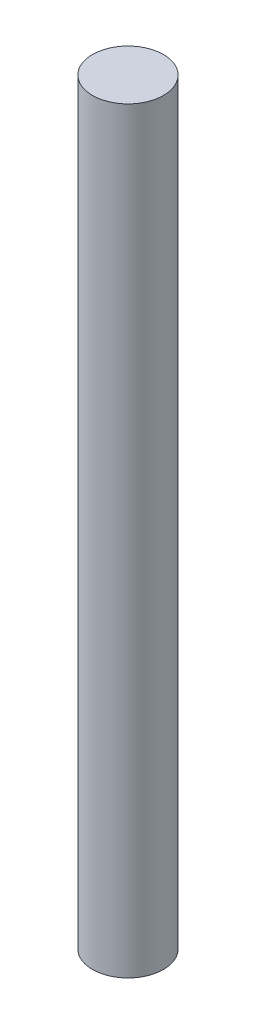
ISO-10303-21;
HEADER;
FILE_DESCRIPTION(('STEP AP214'),'2;1');
FILE_NAME('part.step','',(''),(''),'','','');
FILE_SCHEMA(('AUTOMOTIVE_DESIGN { 1 0 10303 214 1 1 1 1 }'));
ENDSEC;
DATA;
#1=APPLICATION_CONTEXT('core data for automotive mechanical design processes');
#2=APPLICATION_PROTOCOL_DEFINITION('international standard','automotive_design',2000,#1);
#3=PRODUCT_CONTEXT('',#1,'mechanical');
#4=PRODUCT('Part','Part','',(#3));
#5=PRODUCT_RELATED_PRODUCT_CATEGORY('part','',(#4));
#6=PRODUCT_DEFINITION_FORMATION('','',#4);
#7=PRODUCT_DEFINITION_CONTEXT('part definition',#1,'design');
#8=PRODUCT_DEFINITION('design','',#6,#7);
#9=PRODUCT_DEFINITION_SHAPE('','',#8);
#10=(LENGTH_UNIT() NAMED_UNIT(*) SI_UNIT(.MILLI.,.METRE.));
#11=(NAMED_UNIT(*) PLANE_ANGLE_UNIT() SI_UNIT($,.RADIAN.));
#12=(NAMED_UNIT(*) SI_UNIT($,.STERADIAN.) SOLID_ANGLE_UNIT());
#13=UNCERTAINTY_MEASURE_WITH_UNIT(LENGTH_MEASURE(1.E-05),#10,'distance_accuracy_value','');
#14=(GEOMETRIC_REPRESENTATION_CONTEXT(3) GLOBAL_UNCERTAINTY_ASSIGNED_CONTEXT((#13)) GLOBAL_UNIT_ASSIGNED_CONTEXT((#10,
#11,#12)) REPRESENTATION_CONTEXT('',''));
#15=CARTESIAN_POINT('',(0.,0.,0.));
#16=DIRECTION('',(0.,0.,1.));
#17=DIRECTION('',(1.,0.,0.));
#18=AXIS2_PLACEMENT_3D('',#15,#16,#17);
#19=CARTESIAN_POINT('',(0.,50.8,0.));
#20=DIRECTION('',(0.,-1.,0.));
#21=DIRECTION('',(0.,0.,-1.));
#22=AXIS2_PLACEMENT_3D('',#19,#20,#21);
#23=CYLINDRICAL_SURFACE('',#22,2.38125);
#24=CARTESIAN_POINT('',(0.,50.8,0.));
#25=DIRECTION('',(0.,1.,0.));
#26=DIRECTION('',(0.,0.,1.));
#27=AXIS2_PLACEMENT_3D('',#24,#25,#26);
#28=CIRCLE('',#27,2.38125);
#29=CARTESIAN_POINT('',(0.,50.8,2.38125));
#30=VERTEX_POINT('',#29);
#31=EDGE_CURVE('E10',#30,#30,#28,.T.);
#32=ORIENTED_EDGE('',*,*,#31,.F.);
#33=EDGE_LOOP('',(#32));
#34=FACE_BOUND('',#33,.T.);
#35=CARTESIAN_POINT('',(0.,0.,0.));
#36=DIRECTION('',(0.,1.,0.));
#37=DIRECTION('',(0.,0.,1.));
#38=AXIS2_PLACEMENT_3D('',#35,#36,#37);
#39=CIRCLE('',#38,2.38125);
#40=CARTESIAN_POINT('',(0.,0.,2.38125));
#41=VERTEX_POINT('',#40);
#42=EDGE_CURVE('E36',#41,#41,#39,.T.);
#43=ORIENTED_EDGE('',*,*,#42,.T.);
#44=EDGE_LOOP('',(#43));
#45=FACE_BOUND('',#44,.T.);
#46=ADVANCED_FACE('F33',(#34,#45),#23,.T.);
#47=CARTESIAN_POINT('',(0.,50.8,0.));
#48=DIRECTION('',(0.,1.,0.));
#49=DIRECTION('',(0.,0.,1.));
#50=AXIS2_PLACEMENT_3D('',#47,#48,#49);
#51=PLANE('',#50);
#52=ORIENTED_EDGE('',*,*,#31,.T.);
#53=EDGE_LOOP('',(#52));
#54=FACE_BOUND('',#53,.T.);
#55=ADVANCED_FACE('F48',(#54),#51,.T.);
#56=CARTESIAN_POINT('',(0.,0.,0.));
#57=DIRECTION('',(0.,1.,0.));
#58=DIRECTION('',(0.,0.,1.));
#59=AXIS2_PLACEMENT_3D('',#56,#57,#58);
#60=PLANE('',#59);
#61=ORIENTED_EDGE('',*,*,#42,.F.);
#62=EDGE_LOOP('',(#61));
#63=FACE_BOUND('',#62,.T.);
#64=ADVANCED_FACE('F46',(#63),#60,.F.);
#65=CLOSED_SHELL('',(#46,#55,#64));
#66=MANIFOLD_SOLID_BREP('B2',#65);
#67=ADVANCED_BREP_SHAPE_REPRESENTATION('',(#18,#66),#14);
#68=SHAPE_DEFINITION_REPRESENTATION(#9,#67);
ENDSEC;
END-ISO-10303-21;
